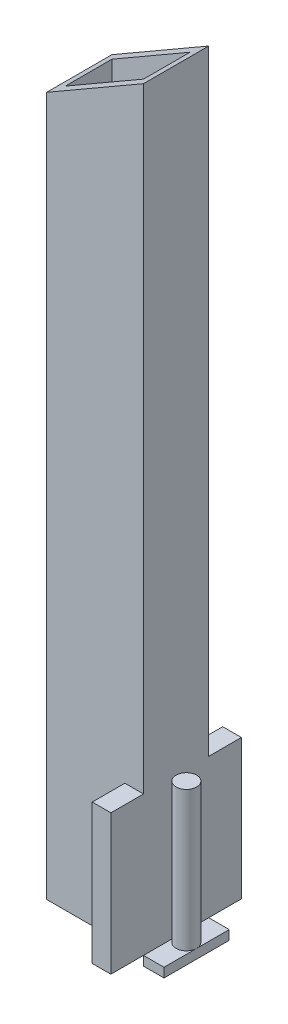
ISO-10303-21;
HEADER;
FILE_DESCRIPTION(('STEP AP214'),'2;1');
FILE_NAME('part.step','',(''),(''),'','','');
FILE_SCHEMA(('AUTOMOTIVE_DESIGN { 1 0 10303 214 1 1 1 1 }'));
ENDSEC;
DATA;
#1=APPLICATION_CONTEXT('core data for automotive mechanical design processes');
#2=APPLICATION_PROTOCOL_DEFINITION('international standard','automotive_design',2000,#1);
#3=PRODUCT_CONTEXT('',#1,'mechanical');
#4=PRODUCT('Part','Part','',(#3));
#5=PRODUCT_RELATED_PRODUCT_CATEGORY('part','',(#4));
#6=PRODUCT_DEFINITION_FORMATION('','',#4);
#7=PRODUCT_DEFINITION_CONTEXT('part definition',#1,'design');
#8=PRODUCT_DEFINITION('design','',#6,#7);
#9=PRODUCT_DEFINITION_SHAPE('','',#8);
#10=(LENGTH_UNIT() NAMED_UNIT(*) SI_UNIT(.MILLI.,.METRE.));
#11=(NAMED_UNIT(*) PLANE_ANGLE_UNIT() SI_UNIT($,.RADIAN.));
#12=(NAMED_UNIT(*) SI_UNIT($,.STERADIAN.) SOLID_ANGLE_UNIT());
#13=UNCERTAINTY_MEASURE_WITH_UNIT(LENGTH_MEASURE(1.E-05),#10,'distance_accuracy_value','');
#14=(GEOMETRIC_REPRESENTATION_CONTEXT(3) GLOBAL_UNCERTAINTY_ASSIGNED_CONTEXT((#13)) GLOBAL_UNIT_ASSIGNED_CONTEXT((#10,
#11,#12)) REPRESENTATION_CONTEXT('',''));
#15=CARTESIAN_POINT('',(0.,0.,0.));
#16=DIRECTION('',(0.,0.,1.));
#17=DIRECTION('',(1.,0.,0.));
#18=AXIS2_PLACEMENT_3D('',#15,#16,#17);
#19=CARTESIAN_POINT('',(11.4923048454133,15.,0.));
#20=DIRECTION('',(0.,-1.,0.));
#21=DIRECTION('',(0.,0.,-1.));
#22=AXIS2_PLACEMENT_3D('',#19,#20,#21);
#23=CYLINDRICAL_SURFACE('',#22,1.1);
#24=CARTESIAN_POINT('',(11.4923048454133,15.,0.));
#25=DIRECTION('',(0.,1.,0.));
#26=DIRECTION('',(0.,0.,1.));
#27=AXIS2_PLACEMENT_3D('',#24,#25,#26);
#28=CIRCLE('',#27,1.1);
#29=CARTESIAN_POINT('',(11.4923048454133,15.,1.1));
#30=VERTEX_POINT('',#29);
#31=EDGE_CURVE('E60',#30,#30,#28,.T.);
#32=ORIENTED_EDGE('',*,*,#31,.F.);
#33=EDGE_LOOP('',(#32));
#34=FACE_BOUND('',#33,.T.);
#35=CARTESIAN_POINT('',(11.4923048454133,0.,0.));
#36=DIRECTION('',(0.,1.,0.));
#37=DIRECTION('',(0.,0.,1.));
#38=AXIS2_PLACEMENT_3D('',#35,#36,#37);
#39=CIRCLE('',#38,1.1);
#40=CARTESIAN_POINT('',(12.5923048454133,0.,0.));
#41=VERTEX_POINT('',#40);
#42=CARTESIAN_POINT('',(10.3923048454133,0.,0.));
#43=VERTEX_POINT('',#42);
#44=EDGE_CURVE('E12',#41,#43,#39,.T.);
#45=ORIENTED_EDGE('',*,*,#44,.T.);
#46=EDGE_CURVE('E65',#43,#41,#39,.T.);
#47=ORIENTED_EDGE('',*,*,#46,.T.);
#48=EDGE_LOOP('',(#45,#47));
#49=FACE_BOUND('',#48,.T.);
#50=ADVANCED_FACE('F56',(#34,#49),#23,.T.);
#51=CARTESIAN_POINT('',(11.4923048454133,15.,0.));
#52=DIRECTION('',(0.,1.,0.));
#53=DIRECTION('',(0.,0.,1.));
#54=AXIS2_PLACEMENT_3D('',#51,#52,#53);
#55=PLANE('',#54);
#56=ORIENTED_EDGE('',*,*,#31,.T.);
#57=EDGE_LOOP('',(#56));
#58=FACE_BOUND('',#57,.T.);
#59=ADVANCED_FACE('F58',(#58),#55,.T.);
#60=CARTESIAN_POINT('',(0.,0.,0.));
#61=DIRECTION('',(0.,1.,0.));
#62=DIRECTION('',(0.,0.,1.));
#63=AXIS2_PLACEMENT_3D('',#60,#61,#62);
#64=PLANE('',#63);
#65=ORIENTED_EDGE('',*,*,#44,.F.);
#66=DIRECTION('',(0.,0.,1.));
#67=VECTOR('',#66,1.);
#68=CARTESIAN_POINT('',(12.5923048454133,0.,0.));
#69=LINE('',#68,#67);
#70=CARTESIAN_POINT('',(12.5923048454133,0.,-3.5));
#71=VERTEX_POINT('',#70);
#72=EDGE_CURVE('E72',#71,#41,#69,.T.);
#73=ORIENTED_EDGE('',*,*,#72,.F.);
#74=DIRECTION('',(1.,0.,0.));
#75=VECTOR('',#74,1.);
#76=CARTESIAN_POINT('',(0.,0.,-3.5));
#77=LINE('',#76,#75);
#78=CARTESIAN_POINT('',(10.3923048454133,0.,-3.5));
#79=VERTEX_POINT('',#78);
#80=EDGE_CURVE('E130',#79,#71,#77,.T.);
#81=ORIENTED_EDGE('',*,*,#80,.F.);
#82=DIRECTION('',(0.,0.,-1.));
#83=VECTOR('',#82,1.);
#84=CARTESIAN_POINT('',(10.3923048454133,0.,0.));
#85=LINE('',#84,#83);
#86=EDGE_CURVE('E138',#43,#79,#85,.T.);
#87=ORIENTED_EDGE('',*,*,#86,.F.);
#88=EDGE_LOOP('',(#65,#73,#81,#87));
#89=FACE_BOUND('',#88,.T.);
#90=ADVANCED_FACE('F150',(#89),#64,.T.);
#91=ORIENTED_EDGE('',*,*,#46,.F.);
#92=CARTESIAN_POINT('',(10.3923048454133,0.,3.5));
#93=VERTEX_POINT('',#92);
#94=EDGE_CURVE('E136',#93,#43,#85,.T.);
#95=ORIENTED_EDGE('',*,*,#94,.F.);
#96=DIRECTION('',(-1.,0.,0.));
#97=VECTOR('',#96,1.);
#98=CARTESIAN_POINT('',(0.,0.,3.5));
#99=LINE('',#98,#97);
#100=CARTESIAN_POINT('',(12.5923048454133,0.,3.5));
#101=VERTEX_POINT('',#100);
#102=EDGE_CURVE('E121',#101,#93,#99,.T.);
#103=ORIENTED_EDGE('',*,*,#102,.F.);
#104=EDGE_CURVE('E140',#41,#101,#69,.T.);
#105=ORIENTED_EDGE('',*,*,#104,.F.);
#106=EDGE_LOOP('',(#91,#95,#103,#105));
#107=FACE_BOUND('',#106,.T.);
#108=ADVANCED_FACE('F145',(#107),#64,.T.);
#109=CARTESIAN_POINT('',(10.3923048454133,-1.,0.));
#110=DIRECTION('',(1.,0.,0.));
#111=DIRECTION('',(0.,0.,-1.));
#112=AXIS2_PLACEMENT_3D('',#109,#110,#111);
#113=PLANE('',#112);
#114=ORIENTED_EDGE('',*,*,#94,.T.);
#115=ORIENTED_EDGE('',*,*,#86,.T.);
#116=DIRECTION('',(0.,1.,0.));
#117=VECTOR('',#116,1.);
#118=CARTESIAN_POINT('',(10.3923048454133,-1.,-3.5));
#119=LINE('',#118,#117);
#120=CARTESIAN_POINT('',(10.3923048454133,-1.,-3.5));
#121=VERTEX_POINT('',#120);
#122=EDGE_CURVE('E129',#121,#79,#119,.T.);
#123=ORIENTED_EDGE('',*,*,#122,.F.);
#124=DIRECTION('',(0.,0.,-1.));
#125=VECTOR('',#124,1.);
#126=CARTESIAN_POINT('',(10.3923048454133,-1.,0.));
#127=LINE('',#126,#125);
#128=CARTESIAN_POINT('',(10.3923048454133,-1.,3.5));
#129=VERTEX_POINT('',#128);
#130=EDGE_CURVE('E109',#129,#121,#127,.T.);
#131=ORIENTED_EDGE('',*,*,#130,.F.);
#132=DIRECTION('',(0.,1.,0.));
#133=VECTOR('',#132,1.);
#134=CARTESIAN_POINT('',(10.3923048454133,-1.,3.5));
#135=LINE('',#134,#133);
#136=EDGE_CURVE('E118',#129,#93,#135,.T.);
#137=ORIENTED_EDGE('',*,*,#136,.T.);
#138=EDGE_LOOP('',(#114,#115,#123,#131,#137));
#139=FACE_BOUND('',#138,.T.);
#140=ADVANCED_FACE('F127',(#139),#113,.F.);
#141=CARTESIAN_POINT('',(0.,-1.,-3.5));
#142=DIRECTION('',(0.,0.,1.));
#143=DIRECTION('',(1.,0.,0.));
#144=AXIS2_PLACEMENT_3D('',#141,#142,#143);
#145=PLANE('',#144);
#146=ORIENTED_EDGE('',*,*,#80,.T.);
#147=DIRECTION('',(0.,1.,0.));
#148=VECTOR('',#147,1.);
#149=CARTESIAN_POINT('',(12.5923048454133,-1.,-3.5));
#150=LINE('',#149,#148);
#151=CARTESIAN_POINT('',(12.5923048454133,-1.,-3.5));
#152=VERTEX_POINT('',#151);
#153=EDGE_CURVE('E143',#152,#71,#150,.T.);
#154=ORIENTED_EDGE('',*,*,#153,.F.);
#155=DIRECTION('',(1.,0.,0.));
#156=VECTOR('',#155,1.);
#157=CARTESIAN_POINT('',(0.,-1.,-3.5));
#158=LINE('',#157,#156);
#159=EDGE_CURVE('E125',#121,#152,#158,.T.);
#160=ORIENTED_EDGE('',*,*,#159,.F.);
#161=ORIENTED_EDGE('',*,*,#122,.T.);
#162=EDGE_LOOP('',(#146,#154,#160,#161));
#163=FACE_BOUND('',#162,.T.);
#164=ADVANCED_FACE('F153',(#163),#145,.F.);
#165=CARTESIAN_POINT('',(12.5923048454133,-1.,0.));
#166=DIRECTION('',(-1.,0.,0.));
#167=DIRECTION('',(0.,0.,1.));
#168=AXIS2_PLACEMENT_3D('',#165,#166,#167);
#169=PLANE('',#168);
#170=ORIENTED_EDGE('',*,*,#72,.T.);
#171=ORIENTED_EDGE('',*,*,#104,.T.);
#172=DIRECTION('',(0.,1.,0.));
#173=VECTOR('',#172,1.);
#174=CARTESIAN_POINT('',(12.5923048454133,-1.,3.5));
#175=LINE('',#174,#173);
#176=CARTESIAN_POINT('',(12.5923048454133,-1.,3.5));
#177=VERTEX_POINT('',#176);
#178=EDGE_CURVE('E124',#177,#101,#175,.T.);
#179=ORIENTED_EDGE('',*,*,#178,.F.);
#180=DIRECTION('',(0.,0.,1.));
#181=VECTOR('',#180,1.);
#182=CARTESIAN_POINT('',(12.5923048454133,-1.,0.));
#183=LINE('',#182,#181);
#184=EDGE_CURVE('E112',#152,#177,#183,.T.);
#185=ORIENTED_EDGE('',*,*,#184,.F.);
#186=ORIENTED_EDGE('',*,*,#153,.T.);
#187=EDGE_LOOP('',(#170,#171,#179,#185,#186));
#188=FACE_BOUND('',#187,.T.);
#189=ADVANCED_FACE('F154',(#188),#169,.F.);
#190=CARTESIAN_POINT('',(0.,-1.,3.5));
#191=DIRECTION('',(0.,0.,-1.));
#192=DIRECTION('',(-1.,0.,0.));
#193=AXIS2_PLACEMENT_3D('',#190,#191,#192);
#194=PLANE('',#193);
#195=ORIENTED_EDGE('',*,*,#102,.T.);
#196=ORIENTED_EDGE('',*,*,#136,.F.);
#197=DIRECTION('',(-1.,0.,0.));
#198=VECTOR('',#197,1.);
#199=CARTESIAN_POINT('',(0.,-1.,3.5));
#200=LINE('',#199,#198);
#201=EDGE_CURVE('E105',#177,#129,#200,.T.);
#202=ORIENTED_EDGE('',*,*,#201,.F.);
#203=ORIENTED_EDGE('',*,*,#178,.T.);
#204=EDGE_LOOP('',(#195,#196,#202,#203));
#205=FACE_BOUND('',#204,.T.);
#206=ADVANCED_FACE('F119',(#205),#194,.F.);
#207=CARTESIAN_POINT('',(0.,-1.,0.));
#208=DIRECTION('',(0.,1.,0.));
#209=DIRECTION('',(0.,0.,1.));
#210=AXIS2_PLACEMENT_3D('',#207,#208,#209);
#211=PLANE('',#210);
#212=ORIENTED_EDGE('',*,*,#130,.T.);
#213=ORIENTED_EDGE('',*,*,#159,.T.);
#214=ORIENTED_EDGE('',*,*,#184,.T.);
#215=ORIENTED_EDGE('',*,*,#201,.T.);
#216=EDGE_LOOP('',(#212,#213,#214,#215));
#217=FACE_BOUND('',#216,.T.);
#218=ADVANCED_FACE('F107',(#217),#211,.F.);
#219=CLOSED_SHELL('',(#50,#59,#90,#108,#140,#164,#189,#206,#218));
#220=MANIFOLD_SOLID_BREP('B2',#219);
#221=CARTESIAN_POINT('',(0.,0.,3.5));
#222=DIRECTION('',(0.,0.,-1.));
#223=DIRECTION('',(-1.,0.,0.));
#224=AXIS2_PLACEMENT_3D('',#221,#222,#223);
#225=PLANE('',#224);
#226=DIRECTION('',(0.,-1.,0.));
#227=VECTOR('',#226,1.);
#228=CARTESIAN_POINT('',(8.39230484541326,15.,3.5));
#229=LINE('',#228,#227);
#230=CARTESIAN_POINT('',(8.39230484541326,15.,3.5));
#231=VERTEX_POINT('',#230);
#232=CARTESIAN_POINT('',(8.39230484541326,0.,3.5));
#233=VERTEX_POINT('',#232);
#234=EDGE_CURVE('E368',#231,#233,#229,.T.);
#235=ORIENTED_EDGE('',*,*,#234,.F.);
#236=DIRECTION('',(1.,0.,0.));
#237=VECTOR('',#236,1.);
#238=CARTESIAN_POINT('',(0.,15.,3.5));
#239=LINE('',#238,#237);
#240=CARTESIAN_POINT('',(10.3923048454133,15.,3.5));
#241=VERTEX_POINT('',#240);
#242=EDGE_CURVE('E361',#231,#241,#239,.T.);
#243=ORIENTED_EDGE('',*,*,#242,.T.);
#244=DIRECTION('',(0.,1.,0.));
#245=VECTOR('',#244,1.);
#246=CARTESIAN_POINT('',(10.3923048454133,81.,3.5));
#247=LINE('',#246,#245);
#248=CARTESIAN_POINT('',(10.3923048454133,81.,3.5));
#249=VERTEX_POINT('',#248);
#250=EDGE_CURVE('E430',#241,#249,#247,.T.);
#251=ORIENTED_EDGE('',*,*,#250,.T.);
#252=DIRECTION('',(-0.866025403784438,-0.500000000000001,0.));
#253=VECTOR('',#252,1.);
#254=CARTESIAN_POINT('',(0.,75.,3.5));
#255=LINE('',#254,#253);
#256=CARTESIAN_POINT('',(0.,75.,3.5));
#257=VERTEX_POINT('',#256);
#258=EDGE_CURVE('E433',#249,#257,#255,.T.);
#259=ORIENTED_EDGE('',*,*,#258,.T.);
#260=DIRECTION('',(0.,-1.,0.));
#261=VECTOR('',#260,1.);
#262=CARTESIAN_POINT('',(0.,0.,3.5));
#263=LINE('',#262,#261);
#264=CARTESIAN_POINT('',(0.,0.,3.5));
#265=VERTEX_POINT('',#264);
#266=EDGE_CURVE('E435',#257,#265,#263,.T.);
#267=ORIENTED_EDGE('',*,*,#266,.T.);
#268=DIRECTION('',(1.,0.,0.));
#269=VECTOR('',#268,1.);
#270=CARTESIAN_POINT('',(10.3923048454133,0.,3.5));
#271=LINE('',#270,#269);
#272=EDGE_CURVE('E427',#265,#233,#271,.T.);
#273=ORIENTED_EDGE('',*,*,#272,.T.);
#274=EDGE_LOOP('',(#235,#243,#251,#259,#267,#273));
#275=FACE_BOUND('',#274,.T.);
#276=ADVANCED_FACE('F239',(#275),#225,.F.);
#277=CARTESIAN_POINT('',(10.3923048454133,0.,3.5));
#278=DIRECTION('',(0.,1.,0.));
#279=DIRECTION('',(-1.,0.,0.));
#280=AXIS2_PLACEMENT_3D('',#277,#278,#279);
#281=PLANE('',#280);
#282=DIRECTION('',(1.,0.,0.));
#283=VECTOR('',#282,1.);
#284=CARTESIAN_POINT('',(10.3923048454133,0.,-3.5));
#285=LINE('',#284,#283);
#286=CARTESIAN_POINT('',(0.,0.,-3.5));
#287=VERTEX_POINT('',#286);
#288=CARTESIAN_POINT('',(8.39230484541326,0.,-3.5));
#289=VERTEX_POINT('',#288);
#290=EDGE_CURVE('E420',#287,#289,#285,.T.);
#291=ORIENTED_EDGE('',*,*,#290,.T.);
#292=DIRECTION('',(0.,0.,1.));
#293=VECTOR('',#292,1.);
#294=CARTESIAN_POINT('',(8.39230484541326,0.,0.));
#295=LINE('',#294,#293);
#296=CARTESIAN_POINT('',(8.39230484541326,0.,-7.));
#297=VERTEX_POINT('',#296);
#298=EDGE_CURVE('E262',#297,#289,#295,.T.);
#299=ORIENTED_EDGE('',*,*,#298,.F.);
#300=DIRECTION('',(-1.,0.,0.));
#301=VECTOR('',#300,1.);
#302=CARTESIAN_POINT('',(0.,0.,-7.));
#303=LINE('',#302,#301);
#304=CARTESIAN_POINT('',(10.3923048454133,0.,-7.));
#305=VERTEX_POINT('',#304);
#306=EDGE_CURVE('E347',#305,#297,#303,.T.);
#307=ORIENTED_EDGE('',*,*,#306,.F.);
#308=DIRECTION('',(0.,0.,-1.));
#309=VECTOR('',#308,1.);
#310=CARTESIAN_POINT('',(10.3923048454133,0.,3.5));
#311=LINE('',#310,#309);
#312=CARTESIAN_POINT('',(10.3923048454133,0.,7.));
#313=VERTEX_POINT('',#312);
#314=EDGE_CURVE('E54',#313,#305,#311,.T.);
#315=ORIENTED_EDGE('',*,*,#314,.F.);
#316=DIRECTION('',(1.,0.,0.));
#317=VECTOR('',#316,1.);
#318=CARTESIAN_POINT('',(0.,0.,7.));
#319=LINE('',#318,#317);
#320=CARTESIAN_POINT('',(8.39230484541326,0.,7.));
#321=VERTEX_POINT('',#320);
#322=EDGE_CURVE('E346',#321,#313,#319,.T.);
#323=ORIENTED_EDGE('',*,*,#322,.F.);
#324=DIRECTION('',(0.,0.,1.));
#325=VECTOR('',#324,1.);
#326=CARTESIAN_POINT('',(8.39230484541326,0.,0.));
#327=LINE('',#326,#325);
#328=EDGE_CURVE('E360',#233,#321,#327,.T.);
#329=ORIENTED_EDGE('',*,*,#328,.F.);
#330=ORIENTED_EDGE('',*,*,#272,.F.);
#331=DIRECTION('',(0.,0.,-1.));
#332=VECTOR('',#331,1.);
#333=CARTESIAN_POINT('',(0.,0.,3.5));
#334=LINE('',#333,#332);
#335=EDGE_CURVE('E437',#265,#287,#334,.T.);
#336=ORIENTED_EDGE('',*,*,#335,.T.);
#337=EDGE_LOOP('',(#291,#299,#307,#315,#323,#329,#330,#336));
#338=FACE_BOUND('',#337,.T.);
#339=DIRECTION('',(1.,0.,0.));
#340=VECTOR('',#339,1.);
#341=CARTESIAN_POINT('',(0.,0.,-2.5));
#342=LINE('',#341,#340);
#343=CARTESIAN_POINT('',(1.,0.,-2.5));
#344=VERTEX_POINT('',#343);
#345=CARTESIAN_POINT('',(9.39230484541327,0.,-2.5));
#346=VERTEX_POINT('',#345);
#347=EDGE_CURVE('E393',#344,#346,#342,.T.);
#348=ORIENTED_EDGE('',*,*,#347,.F.);
#349=DIRECTION('',(0.,0.,-1.));
#350=VECTOR('',#349,1.);
#351=CARTESIAN_POINT('',(1.,0.,3.5));
#352=LINE('',#351,#350);
#353=CARTESIAN_POINT('',(1.,0.,2.5));
#354=VERTEX_POINT('',#353);
#355=EDGE_CURVE('E405',#354,#344,#352,.T.);
#356=ORIENTED_EDGE('',*,*,#355,.F.);
#357=DIRECTION('',(1.,0.,0.));
#358=VECTOR('',#357,1.);
#359=CARTESIAN_POINT('',(0.,0.,2.5));
#360=LINE('',#359,#358);
#361=CARTESIAN_POINT('',(9.39230484541327,0.,2.5));
#362=VERTEX_POINT('',#361);
#363=EDGE_CURVE('E401',#354,#362,#360,.T.);
#364=ORIENTED_EDGE('',*,*,#363,.T.);
#365=DIRECTION('',(0.,0.,-1.));
#366=VECTOR('',#365,1.);
#367=CARTESIAN_POINT('',(9.39230484541327,0.,3.5));
#368=LINE('',#367,#366);
#369=EDGE_CURVE('E411',#362,#346,#368,.T.);
#370=ORIENTED_EDGE('',*,*,#369,.T.);
#371=EDGE_LOOP('',(#348,#356,#364,#370));
#372=FACE_BOUND('',#371,.T.);
#373=ADVANCED_FACE('F241',(#338,#372),#281,.F.);
#374=CARTESIAN_POINT('',(0.,75.,3.5));
#375=DIRECTION('',(0.500000000000001,-0.866025403784438,0.));
#376=DIRECTION('',(0.866025403784438,0.500000000000001,0.));
#377=AXIS2_PLACEMENT_3D('',#374,#375,#376);
#378=PLANE('',#377);
#379=DIRECTION('',(-0.866025403784438,-0.500000000000001,0.));
#380=VECTOR('',#379,1.);
#381=CARTESIAN_POINT('',(0.,75.,-3.5));
#382=LINE('',#381,#380);
#383=CARTESIAN_POINT('',(10.3923048454133,81.,-3.5));
#384=VERTEX_POINT('',#383);
#385=CARTESIAN_POINT('',(0.,75.,-3.5));
#386=VERTEX_POINT('',#385);
#387=EDGE_CURVE('E441',#384,#386,#382,.T.);
#388=ORIENTED_EDGE('',*,*,#387,.T.);
#389=DIRECTION('',(0.,0.,-1.));
#390=VECTOR('',#389,1.);
#391=CARTESIAN_POINT('',(0.,75.,3.5));
#392=LINE('',#391,#390);
#393=EDGE_CURVE('E446',#257,#386,#392,.T.);
#394=ORIENTED_EDGE('',*,*,#393,.F.);
#395=ORIENTED_EDGE('',*,*,#258,.F.);
#396=DIRECTION('',(0.,0.,-1.));
#397=VECTOR('',#396,1.);
#398=CARTESIAN_POINT('',(10.3923048454133,81.,3.5));
#399=LINE('',#398,#397);
#400=EDGE_CURVE('E247',#249,#384,#399,.T.);
#401=ORIENTED_EDGE('',*,*,#400,.T.);
#402=EDGE_LOOP('',(#388,#394,#395,#401));
#403=FACE_BOUND('',#402,.T.);
#404=DIRECTION('',(-0.866025403784438,-0.500000000000001,0.));
#405=VECTOR('',#404,1.);
#406=CARTESIAN_POINT('',(-32.4759526419165,56.2499999999999,-2.5));
#407=LINE('',#406,#405);
#408=CARTESIAN_POINT('',(9.39230484541326,80.4226497308104,-2.5));
#409=VERTEX_POINT('',#408);
#410=CARTESIAN_POINT('',(1.,75.5773502691896,-2.5));
#411=VERTEX_POINT('',#410);
#412=EDGE_CURVE('E396',#409,#411,#407,.T.);
#413=ORIENTED_EDGE('',*,*,#412,.F.);
#414=DIRECTION('',(0.,0.,-1.));
#415=VECTOR('',#414,1.);
#416=CARTESIAN_POINT('',(9.39230484541325,80.4226497308104,3.5));
#417=LINE('',#416,#415);
#418=CARTESIAN_POINT('',(9.39230484541326,80.4226497308104,2.5));
#419=VERTEX_POINT('',#418);
#420=EDGE_CURVE('E408',#419,#409,#417,.T.);
#421=ORIENTED_EDGE('',*,*,#420,.F.);
#422=DIRECTION('',(-0.866025403784438,-0.500000000000001,0.));
#423=VECTOR('',#422,1.);
#424=CARTESIAN_POINT('',(-32.4759526419165,56.2499999999999,2.5));
#425=LINE('',#424,#423);
#426=CARTESIAN_POINT('',(1.,75.5773502691896,2.5));
#427=VERTEX_POINT('',#426);
#428=EDGE_CURVE('E400',#419,#427,#425,.T.);
#429=ORIENTED_EDGE('',*,*,#428,.T.);
#430=DIRECTION('',(0.,0.,-1.));
#431=VECTOR('',#430,1.);
#432=CARTESIAN_POINT('',(1.,75.5773502691896,3.5));
#433=LINE('',#432,#431);
#434=EDGE_CURVE('E412',#427,#411,#433,.T.);
#435=ORIENTED_EDGE('',*,*,#434,.T.);
#436=EDGE_LOOP('',(#413,#421,#429,#435));
#437=FACE_BOUND('',#436,.T.);
#438=ADVANCED_FACE('F453',(#403,#437),#378,.F.);
#439=CARTESIAN_POINT('',(10.3923048454133,81.,3.5));
#440=DIRECTION('',(-1.,0.,0.));
#441=DIRECTION('',(0.,-1.,0.));
#442=AXIS2_PLACEMENT_3D('',#439,#440,#441);
#443=PLANE('',#442);
#444=ORIENTED_EDGE('',*,*,#314,.T.);
#445=DIRECTION('',(0.,-1.,0.));
#446=VECTOR('',#445,1.);
#447=CARTESIAN_POINT('',(10.3923048454133,15.,-7.));
#448=LINE('',#447,#446);
#449=CARTESIAN_POINT('',(10.3923048454133,15.,-7.));
#450=VERTEX_POINT('',#449);
#451=EDGE_CURVE('E389',#450,#305,#448,.T.);
#452=ORIENTED_EDGE('',*,*,#451,.F.);
#453=DIRECTION('',(0.,0.,-1.));
#454=VECTOR('',#453,1.);
#455=CARTESIAN_POINT('',(10.3923048454133,15.,0.));
#456=LINE('',#455,#454);
#457=CARTESIAN_POINT('',(10.3923048454133,15.,-3.5));
#458=VERTEX_POINT('',#457);
#459=EDGE_CURVE('E381',#458,#450,#456,.T.);
#460=ORIENTED_EDGE('',*,*,#459,.F.);
#461=DIRECTION('',(0.,1.,0.));
#462=VECTOR('',#461,1.);
#463=CARTESIAN_POINT('',(10.3923048454133,81.,-3.5));
#464=LINE('',#463,#462);
#465=EDGE_CURVE('E439',#458,#384,#464,.T.);
#466=ORIENTED_EDGE('',*,*,#465,.T.);
#467=ORIENTED_EDGE('',*,*,#400,.F.);
#468=ORIENTED_EDGE('',*,*,#250,.F.);
#469=DIRECTION('',(0.,0.,-1.));
#470=VECTOR('',#469,1.);
#471=CARTESIAN_POINT('',(10.3923048454133,15.,0.));
#472=LINE('',#471,#470);
#473=CARTESIAN_POINT('',(10.3923048454133,15.,7.));
#474=VERTEX_POINT('',#473);
#475=EDGE_CURVE('E254',#474,#241,#472,.T.);
#476=ORIENTED_EDGE('',*,*,#475,.F.);
#477=DIRECTION('',(0.,-1.,0.));
#478=VECTOR('',#477,1.);
#479=CARTESIAN_POINT('',(10.3923048454133,15.,7.));
#480=LINE('',#479,#478);
#481=EDGE_CURVE('E357',#474,#313,#480,.T.);
#482=ORIENTED_EDGE('',*,*,#481,.T.);
#483=EDGE_LOOP('',(#444,#452,#460,#466,#467,#468,#476,#482));
#484=FACE_BOUND('',#483,.T.);
#485=ADVANCED_FACE('F363',(#484),#443,.F.);
#486=CARTESIAN_POINT('',(0.,0.,3.5));
#487=DIRECTION('',(1.,0.,0.));
#488=DIRECTION('',(0.,0.,-1.));
#489=AXIS2_PLACEMENT_3D('',#486,#487,#488);
#490=PLANE('',#489);
#491=DIRECTION('',(0.,-1.,0.));
#492=VECTOR('',#491,1.);
#493=CARTESIAN_POINT('',(0.,0.,-3.5));
#494=LINE('',#493,#492);
#495=EDGE_CURVE('E431',#386,#287,#494,.T.);
#496=ORIENTED_EDGE('',*,*,#495,.T.);
#497=ORIENTED_EDGE('',*,*,#335,.F.);
#498=ORIENTED_EDGE('',*,*,#266,.F.);
#499=ORIENTED_EDGE('',*,*,#393,.T.);
#500=EDGE_LOOP('',(#496,#497,#498,#499));
#501=FACE_BOUND('',#500,.T.);
#502=ADVANCED_FACE('F464',(#501),#490,.F.);
#503=CARTESIAN_POINT('',(0.,0.,-3.5));
#504=DIRECTION('',(0.,0.,-1.));
#505=DIRECTION('',(-1.,0.,0.));
#506=AXIS2_PLACEMENT_3D('',#503,#504,#505);
#507=PLANE('',#506);
#508=DIRECTION('',(1.,0.,0.));
#509=VECTOR('',#508,1.);
#510=CARTESIAN_POINT('',(0.,15.,-3.5));
#511=LINE('',#510,#509);
#512=CARTESIAN_POINT('',(8.39230484541326,15.,-3.5));
#513=VERTEX_POINT('',#512);
#514=EDGE_CURVE('E379',#513,#458,#511,.T.);
#515=ORIENTED_EDGE('',*,*,#514,.F.);
#516=DIRECTION('',(0.,-1.,0.));
#517=VECTOR('',#516,1.);
#518=CARTESIAN_POINT('',(8.39230484541326,15.,-3.5));
#519=LINE('',#518,#517);
#520=EDGE_CURVE('E391',#513,#289,#519,.T.);
#521=ORIENTED_EDGE('',*,*,#520,.T.);
#522=ORIENTED_EDGE('',*,*,#290,.F.);
#523=ORIENTED_EDGE('',*,*,#495,.F.);
#524=ORIENTED_EDGE('',*,*,#387,.F.);
#525=ORIENTED_EDGE('',*,*,#465,.F.);
#526=EDGE_LOOP('',(#515,#521,#522,#523,#524,#525));
#527=FACE_BOUND('',#526,.T.);
#528=ADVANCED_FACE('F460',(#527),#507,.T.);
#529=CARTESIAN_POINT('',(9.39230484541326,81.,3.5));
#530=DIRECTION('',(-1.,0.,0.));
#531=DIRECTION('',(0.,-1.,0.));
#532=AXIS2_PLACEMENT_3D('',#529,#530,#531);
#533=PLANE('',#532);
#534=DIRECTION('',(0.,1.,0.));
#535=VECTOR('',#534,1.);
#536=CARTESIAN_POINT('',(9.39230484541327,0.,-2.5));
#537=LINE('',#536,#535);
#538=EDGE_CURVE('E394',#346,#409,#537,.T.);
#539=ORIENTED_EDGE('',*,*,#538,.F.);
#540=ORIENTED_EDGE('',*,*,#369,.F.);
#541=DIRECTION('',(0.,1.,0.));
#542=VECTOR('',#541,1.);
#543=CARTESIAN_POINT('',(9.39230484541327,0.,2.5));
#544=LINE('',#543,#542);
#545=EDGE_CURVE('E397',#362,#419,#544,.T.);
#546=ORIENTED_EDGE('',*,*,#545,.T.);
#547=ORIENTED_EDGE('',*,*,#420,.T.);
#548=EDGE_LOOP('',(#539,#540,#546,#547));
#549=FACE_BOUND('',#548,.T.);
#550=ADVANCED_FACE('F495',(#549),#533,.T.);
#551=CARTESIAN_POINT('',(1.,0.,3.5));
#552=DIRECTION('',(1.,0.,0.));
#553=DIRECTION('',(0.,0.,-1.));
#554=AXIS2_PLACEMENT_3D('',#551,#552,#553);
#555=PLANE('',#554);
#556=DIRECTION('',(0.,-1.,0.));
#557=VECTOR('',#556,1.);
#558=CARTESIAN_POINT('',(1.,0.,-2.5));
#559=LINE('',#558,#557);
#560=EDGE_CURVE('E406',#411,#344,#559,.T.);
#561=ORIENTED_EDGE('',*,*,#560,.F.);
#562=ORIENTED_EDGE('',*,*,#434,.F.);
#563=DIRECTION('',(0.,-1.,0.));
#564=VECTOR('',#563,1.);
#565=CARTESIAN_POINT('',(1.,0.,2.5));
#566=LINE('',#565,#564);
#567=EDGE_CURVE('E402',#427,#354,#566,.T.);
#568=ORIENTED_EDGE('',*,*,#567,.T.);
#569=ORIENTED_EDGE('',*,*,#355,.T.);
#570=EDGE_LOOP('',(#561,#562,#568,#569));
#571=FACE_BOUND('',#570,.T.);
#572=ADVANCED_FACE('F551',(#571),#555,.T.);
#573=CARTESIAN_POINT('',(0.,0.,2.5));
#574=DIRECTION('',(0.,0.,-1.));
#575=DIRECTION('',(-1.,0.,0.));
#576=AXIS2_PLACEMENT_3D('',#573,#574,#575);
#577=PLANE('',#576);
#578=ORIENTED_EDGE('',*,*,#363,.F.);
#579=ORIENTED_EDGE('',*,*,#567,.F.);
#580=ORIENTED_EDGE('',*,*,#428,.F.);
#581=ORIENTED_EDGE('',*,*,#545,.F.);
#582=EDGE_LOOP('',(#578,#579,#580,#581));
#583=FACE_BOUND('',#582,.T.);
#584=ADVANCED_FACE('F554',(#583),#577,.T.);
#585=CARTESIAN_POINT('',(0.,0.,-2.5));
#586=DIRECTION('',(0.,0.,-1.));
#587=DIRECTION('',(-1.,0.,0.));
#588=AXIS2_PLACEMENT_3D('',#585,#586,#587);
#589=PLANE('',#588);
#590=ORIENTED_EDGE('',*,*,#347,.T.);
#591=ORIENTED_EDGE('',*,*,#538,.T.);
#592=ORIENTED_EDGE('',*,*,#412,.T.);
#593=ORIENTED_EDGE('',*,*,#560,.T.);
#594=EDGE_LOOP('',(#590,#591,#592,#593));
#595=FACE_BOUND('',#594,.T.);
#596=ADVANCED_FACE('F492',(#595),#589,.F.);
#597=CARTESIAN_POINT('',(8.39230484541326,15.,0.));
#598=DIRECTION('',(1.,0.,0.));
#599=DIRECTION('',(0.,0.,-1.));
#600=AXIS2_PLACEMENT_3D('',#597,#598,#599);
#601=PLANE('',#600);
#602=ORIENTED_EDGE('',*,*,#298,.T.);
#603=ORIENTED_EDGE('',*,*,#520,.F.);
#604=DIRECTION('',(0.,0.,1.));
#605=VECTOR('',#604,1.);
#606=CARTESIAN_POINT('',(8.39230484541326,15.,0.));
#607=LINE('',#606,#605);
#608=CARTESIAN_POINT('',(8.39230484541326,15.,-7.));
#609=VERTEX_POINT('',#608);
#610=EDGE_CURVE('E377',#609,#513,#607,.T.);
#611=ORIENTED_EDGE('',*,*,#610,.F.);
#612=DIRECTION('',(0.,-1.,0.));
#613=VECTOR('',#612,1.);
#614=CARTESIAN_POINT('',(8.39230484541326,15.,-7.));
#615=LINE('',#614,#613);
#616=EDGE_CURVE('E385',#609,#297,#615,.T.);
#617=ORIENTED_EDGE('',*,*,#616,.T.);
#618=EDGE_LOOP('',(#602,#603,#611,#617));
#619=FACE_BOUND('',#618,.T.);
#620=ADVANCED_FACE('F507',(#619),#601,.F.);
#621=CARTESIAN_POINT('',(0.,15.,-7.));
#622=DIRECTION('',(0.,0.,1.));
#623=DIRECTION('',(1.,0.,0.));
#624=AXIS2_PLACEMENT_3D('',#621,#622,#623);
#625=PLANE('',#624);
#626=ORIENTED_EDGE('',*,*,#306,.T.);
#627=ORIENTED_EDGE('',*,*,#616,.F.);
#628=DIRECTION('',(-1.,0.,0.));
#629=VECTOR('',#628,1.);
#630=CARTESIAN_POINT('',(0.,15.,-7.));
#631=LINE('',#630,#629);
#632=EDGE_CURVE('E383',#450,#609,#631,.T.);
#633=ORIENTED_EDGE('',*,*,#632,.F.);
#634=ORIENTED_EDGE('',*,*,#451,.T.);
#635=EDGE_LOOP('',(#626,#627,#633,#634));
#636=FACE_BOUND('',#635,.T.);
#637=ADVANCED_FACE('F480',(#636),#625,.F.);
#638=CARTESIAN_POINT('',(0.,15.,0.));
#639=DIRECTION('',(0.,1.,0.));
#640=DIRECTION('',(0.,0.,1.));
#641=AXIS2_PLACEMENT_3D('',#638,#639,#640);
#642=PLANE('',#641);
#643=ORIENTED_EDGE('',*,*,#610,.T.);
#644=ORIENTED_EDGE('',*,*,#514,.T.);
#645=ORIENTED_EDGE('',*,*,#459,.T.);
#646=ORIENTED_EDGE('',*,*,#632,.T.);
#647=EDGE_LOOP('',(#643,#644,#645,#646));
#648=FACE_BOUND('',#647,.T.);
#649=ADVANCED_FACE('F473',(#648),#642,.T.);
#650=CARTESIAN_POINT('',(8.39230484541326,15.,0.));
#651=DIRECTION('',(1.,0.,0.));
#652=DIRECTION('',(0.,0.,-1.));
#653=AXIS2_PLACEMENT_3D('',#650,#651,#652);
#654=PLANE('',#653);
#655=ORIENTED_EDGE('',*,*,#328,.T.);
#656=DIRECTION('',(0.,-1.,0.));
#657=VECTOR('',#656,1.);
#658=CARTESIAN_POINT('',(8.39230484541326,15.,7.));
#659=LINE('',#658,#657);
#660=CARTESIAN_POINT('',(8.39230484541326,15.,7.));
#661=VERTEX_POINT('',#660);
#662=EDGE_CURVE('E359',#661,#321,#659,.T.);
#663=ORIENTED_EDGE('',*,*,#662,.F.);
#664=DIRECTION('',(0.,0.,1.));
#665=VECTOR('',#664,1.);
#666=CARTESIAN_POINT('',(8.39230484541326,15.,0.));
#667=LINE('',#666,#665);
#668=EDGE_CURVE('E374',#231,#661,#667,.T.);
#669=ORIENTED_EDGE('',*,*,#668,.F.);
#670=ORIENTED_EDGE('',*,*,#234,.T.);
#671=EDGE_LOOP('',(#655,#663,#669,#670));
#672=FACE_BOUND('',#671,.T.);
#673=ADVANCED_FACE('F471',(#672),#654,.F.);
#674=CARTESIAN_POINT('',(0.,15.,7.));
#675=DIRECTION('',(0.,0.,-1.));
#676=DIRECTION('',(-1.,0.,0.));
#677=AXIS2_PLACEMENT_3D('',#674,#675,#676);
#678=PLANE('',#677);
#679=ORIENTED_EDGE('',*,*,#322,.T.);
#680=ORIENTED_EDGE('',*,*,#481,.F.);
#681=DIRECTION('',(1.,0.,0.));
#682=VECTOR('',#681,1.);
#683=CARTESIAN_POINT('',(0.,15.,7.));
#684=LINE('',#683,#682);
#685=EDGE_CURVE('E366',#661,#474,#684,.T.);
#686=ORIENTED_EDGE('',*,*,#685,.F.);
#687=ORIENTED_EDGE('',*,*,#662,.T.);
#688=EDGE_LOOP('',(#679,#680,#686,#687));
#689=FACE_BOUND('',#688,.T.);
#690=ADVANCED_FACE('F355',(#689),#678,.F.);
#691=CARTESIAN_POINT('',(0.,15.,0.));
#692=DIRECTION('',(0.,1.,0.));
#693=DIRECTION('',(0.,0.,1.));
#694=AXIS2_PLACEMENT_3D('',#691,#692,#693);
#695=PLANE('',#694);
#696=ORIENTED_EDGE('',*,*,#242,.F.);
#697=ORIENTED_EDGE('',*,*,#668,.T.);
#698=ORIENTED_EDGE('',*,*,#685,.T.);
#699=ORIENTED_EDGE('',*,*,#475,.T.);
#700=EDGE_LOOP('',(#696,#697,#698,#699));
#701=FACE_BOUND('',#700,.T.);
#702=ADVANCED_FACE('F469',(#701),#695,.T.);
#703=CLOSED_SHELL('',(#276,#373,#438,#485,#502,#528,#550,#572,#584,#596,#620,#637,#649,#673,
#690,#702));
#704=MANIFOLD_SOLID_BREP('B6',#703);
#705=ADVANCED_BREP_SHAPE_REPRESENTATION('',(#18,#220,#704),#14);
#706=SHAPE_DEFINITION_REPRESENTATION(#9,#705);
ENDSEC;
END-ISO-10303-21;
